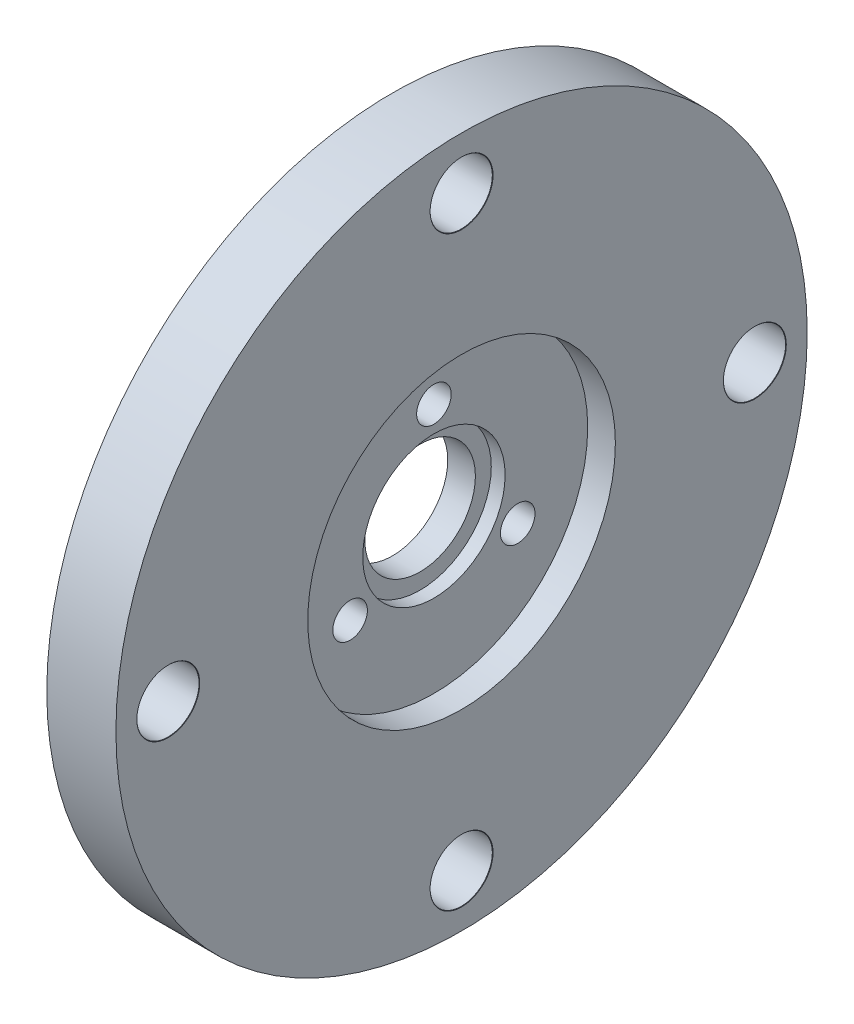
ISO-10303-21;
HEADER;
FILE_DESCRIPTION(('STEP AP214'),'2;1');
FILE_NAME('part.step','',(''),(''),'','','');
FILE_SCHEMA(('AUTOMOTIVE_DESIGN { 1 0 10303 214 1 1 1 1 }'));
ENDSEC;
DATA;
#1=APPLICATION_CONTEXT('core data for automotive mechanical design processes');
#2=APPLICATION_PROTOCOL_DEFINITION('international standard','automotive_design',2000,#1);
#3=PRODUCT_CONTEXT('',#1,'mechanical');
#4=PRODUCT('Part','Part','',(#3));
#5=PRODUCT_RELATED_PRODUCT_CATEGORY('part','',(#4));
#6=PRODUCT_DEFINITION_FORMATION('','',#4);
#7=PRODUCT_DEFINITION_CONTEXT('part definition',#1,'design');
#8=PRODUCT_DEFINITION('design','',#6,#7);
#9=PRODUCT_DEFINITION_SHAPE('','',#8);
#10=(LENGTH_UNIT() NAMED_UNIT(*) SI_UNIT(.MILLI.,.METRE.));
#11=(NAMED_UNIT(*) PLANE_ANGLE_UNIT() SI_UNIT($,.RADIAN.));
#12=(NAMED_UNIT(*) SI_UNIT($,.STERADIAN.) SOLID_ANGLE_UNIT());
#13=UNCERTAINTY_MEASURE_WITH_UNIT(LENGTH_MEASURE(1.E-05),#10,'distance_accuracy_value','');
#14=(GEOMETRIC_REPRESENTATION_CONTEXT(3) GLOBAL_UNCERTAINTY_ASSIGNED_CONTEXT((#13)) GLOBAL_UNIT_ASSIGNED_CONTEXT((#10,
#11,#12)) REPRESENTATION_CONTEXT('',''));
#15=CARTESIAN_POINT('',(0.,0.,0.));
#16=DIRECTION('',(0.,0.,1.));
#17=DIRECTION('',(1.,0.,0.));
#18=AXIS2_PLACEMENT_3D('',#15,#16,#17);
#19=CARTESIAN_POINT('',(2.,0.,0.));
#20=DIRECTION('',(1.,0.,0.));
#21=DIRECTION('',(0.,0.,-1.));
#22=AXIS2_PLACEMENT_3D('',#19,#20,#21);
#23=CYLINDRICAL_SURFACE('',#22,5.15);
#24=CARTESIAN_POINT('',(2.,0.,0.));
#25=DIRECTION('',(1.,0.,0.));
#26=DIRECTION('',(0.,0.,-1.));
#27=AXIS2_PLACEMENT_3D('',#24,#25,#26);
#28=CIRCLE('',#27,5.15);
#29=CARTESIAN_POINT('',(2.,0.,-5.15));
#30=VERTEX_POINT('',#29);
#31=EDGE_CURVE('E66',#30,#30,#28,.T.);
#32=ORIENTED_EDGE('',*,*,#31,.F.);
#33=EDGE_LOOP('',(#32));
#34=FACE_BOUND('',#33,.T.);
#35=CARTESIAN_POINT('',(3.,0.,0.));
#36=DIRECTION('',(1.,0.,0.));
#37=DIRECTION('',(0.,0.,-1.));
#38=AXIS2_PLACEMENT_3D('',#35,#36,#37);
#39=CIRCLE('',#38,5.15);
#40=CARTESIAN_POINT('',(3.,0.,-5.15));
#41=VERTEX_POINT('',#40);
#42=EDGE_CURVE('E67',#41,#41,#39,.F.);
#43=ORIENTED_EDGE('',*,*,#42,.F.);
#44=EDGE_LOOP('',(#43));
#45=FACE_BOUND('',#44,.T.);
#46=ADVANCED_FACE('F42',(#34,#45),#23,.F.);
#47=CARTESIAN_POINT('',(5.,0.,0.));
#48=DIRECTION('',(-1.,0.,0.));
#49=DIRECTION('',(0.,0.,1.));
#50=AXIS2_PLACEMENT_3D('',#47,#48,#49);
#51=CYLINDRICAL_SURFACE('',#50,4.);
#52=CARTESIAN_POINT('',(0.,0.,0.));
#53=DIRECTION('',(1.,0.,0.));
#54=DIRECTION('',(0.,0.,-1.));
#55=AXIS2_PLACEMENT_3D('',#52,#53,#54);
#56=CIRCLE('',#55,4.);
#57=CARTESIAN_POINT('',(0.,0.,-4.));
#58=VERTEX_POINT('',#57);
#59=EDGE_CURVE('E57',#58,#58,#56,.T.);
#60=ORIENTED_EDGE('',*,*,#59,.F.);
#61=EDGE_LOOP('',(#60));
#62=FACE_BOUND('',#61,.T.);
#63=CARTESIAN_POINT('',(2.,0.,0.));
#64=DIRECTION('',(1.,0.,0.));
#65=DIRECTION('',(0.,0.,-1.));
#66=AXIS2_PLACEMENT_3D('',#63,#64,#65);
#67=CIRCLE('',#66,4.);
#68=CARTESIAN_POINT('',(2.,0.,-4.));
#69=VERTEX_POINT('',#68);
#70=EDGE_CURVE('E62',#69,#69,#67,.T.);
#71=ORIENTED_EDGE('',*,*,#70,.T.);
#72=EDGE_LOOP('',(#71));
#73=FACE_BOUND('',#72,.T.);
#74=ADVANCED_FACE('F150',(#62,#73),#51,.F.);
#75=CARTESIAN_POINT('',(5.,0.,0.));
#76=DIRECTION('',(1.,0.,0.));
#77=DIRECTION('',(0.,0.,-1.));
#78=AXIS2_PLACEMENT_3D('',#75,#76,#77);
#79=PLANE('',#78);
#80=CARTESIAN_POINT('',(5.,0.,21.2132034355964));
#81=DIRECTION('',(1.,0.,0.));
#82=DIRECTION('',(0.,0.,-1.));
#83=AXIS2_PLACEMENT_3D('',#80,#81,#82);
#84=CIRCLE('',#83,2.275);
#85=CARTESIAN_POINT('',(5.,0.,18.9382034355964));
#86=VERTEX_POINT('',#85);
#87=EDGE_CURVE('E268',#86,#86,#84,.T.);
#88=ORIENTED_EDGE('',*,*,#87,.F.);
#89=EDGE_LOOP('',(#88));
#90=FACE_BOUND('',#89,.T.);
#91=CARTESIAN_POINT('',(5.,21.2132034355964,0.));
#92=DIRECTION('',(1.,0.,0.));
#93=DIRECTION('',(0.,0.,-1.));
#94=AXIS2_PLACEMENT_3D('',#91,#92,#93);
#95=CIRCLE('',#94,2.275);
#96=CARTESIAN_POINT('',(5.,21.2132034355964,-2.275));
#97=VERTEX_POINT('',#96);
#98=EDGE_CURVE('E95',#97,#97,#95,.T.);
#99=ORIENTED_EDGE('',*,*,#98,.F.);
#100=EDGE_LOOP('',(#99));
#101=FACE_BOUND('',#100,.T.);
#102=CARTESIAN_POINT('',(5.,0.,-21.2132034355964));
#103=DIRECTION('',(1.,0.,0.));
#104=DIRECTION('',(0.,0.,-1.));
#105=AXIS2_PLACEMENT_3D('',#102,#103,#104);
#106=CIRCLE('',#105,2.275);
#107=CARTESIAN_POINT('',(5.,0.,-23.4882034355964));
#108=VERTEX_POINT('',#107);
#109=EDGE_CURVE('E86',#108,#108,#106,.T.);
#110=ORIENTED_EDGE('',*,*,#109,.F.);
#111=EDGE_LOOP('',(#110));
#112=FACE_BOUND('',#111,.T.);
#113=CARTESIAN_POINT('',(5.,-21.2132034355964,0.));
#114=DIRECTION('',(1.,0.,0.));
#115=DIRECTION('',(0.,0.,-1.));
#116=AXIS2_PLACEMENT_3D('',#113,#114,#115);
#117=CIRCLE('',#116,2.275);
#118=CARTESIAN_POINT('',(5.,-21.2132034355964,-2.275));
#119=VERTEX_POINT('',#118);
#120=EDGE_CURVE('E81',#119,#119,#117,.T.);
#121=ORIENTED_EDGE('',*,*,#120,.F.);
#122=EDGE_LOOP('',(#121));
#123=FACE_BOUND('',#122,.T.);
#124=CARTESIAN_POINT('',(5.,0.,0.));
#125=DIRECTION('',(1.,0.,0.));
#126=DIRECTION('',(0.,0.,-1.));
#127=AXIS2_PLACEMENT_3D('',#124,#125,#126);
#128=CIRCLE('',#127,11.125);
#129=CARTESIAN_POINT('',(5.,0.,-11.125));
#130=VERTEX_POINT('',#129);
#131=EDGE_CURVE('E117',#130,#130,#128,.T.);
#132=ORIENTED_EDGE('',*,*,#131,.F.);
#133=EDGE_LOOP('',(#132));
#134=FACE_BOUND('',#133,.T.);
#135=CARTESIAN_POINT('',(5.,0.,0.));
#136=DIRECTION('',(1.,0.,0.));
#137=DIRECTION('',(0.,0.,-1.));
#138=AXIS2_PLACEMENT_3D('',#135,#136,#137);
#139=CIRCLE('',#138,25.);
#140=CARTESIAN_POINT('',(5.,0.,-25.));
#141=VERTEX_POINT('',#140);
#142=EDGE_CURVE('E10',#141,#141,#139,.T.);
#143=ORIENTED_EDGE('',*,*,#142,.T.);
#144=EDGE_LOOP('',(#143));
#145=FACE_BOUND('',#144,.T.);
#146=ADVANCED_FACE('F176',(#90,#101,#112,#123,#134,#145),#79,.T.);
#147=CARTESIAN_POINT('',(0.,0.,0.));
#148=DIRECTION('',(1.,0.,0.));
#149=DIRECTION('',(0.,0.,-1.));
#150=AXIS2_PLACEMENT_3D('',#147,#148,#149);
#151=PLANE('',#150);
#152=CARTESIAN_POINT('',(0.,0.,21.2132034355964));
#153=DIRECTION('',(1.,0.,0.));
#154=DIRECTION('',(0.,0.,-1.));
#155=AXIS2_PLACEMENT_3D('',#152,#153,#154);
#156=CIRCLE('',#155,2.25);
#157=CARTESIAN_POINT('',(0.,0.,18.9632034355964));
#158=VERTEX_POINT('',#157);
#159=EDGE_CURVE('E46',#158,#158,#156,.T.);
#160=ORIENTED_EDGE('',*,*,#159,.T.);
#161=EDGE_LOOP('',(#160));
#162=FACE_BOUND('',#161,.T.);
#163=CARTESIAN_POINT('',(0.,21.2132034355964,0.));
#164=DIRECTION('',(1.,0.,0.));
#165=DIRECTION('',(0.,0.,-1.));
#166=AXIS2_PLACEMENT_3D('',#163,#164,#165);
#167=CIRCLE('',#166,2.25);
#168=CARTESIAN_POINT('',(0.,21.2132034355964,-2.25));
#169=VERTEX_POINT('',#168);
#170=EDGE_CURVE('E83',#169,#169,#167,.T.);
#171=ORIENTED_EDGE('',*,*,#170,.T.);
#172=EDGE_LOOP('',(#171));
#173=FACE_BOUND('',#172,.T.);
#174=CARTESIAN_POINT('',(0.,0.,-21.2132034355964));
#175=DIRECTION('',(1.,0.,0.));
#176=DIRECTION('',(0.,0.,-1.));
#177=AXIS2_PLACEMENT_3D('',#174,#175,#176);
#178=CIRCLE('',#177,2.25);
#179=CARTESIAN_POINT('',(0.,0.,-23.4632034355964));
#180=VERTEX_POINT('',#179);
#181=EDGE_CURVE('E78',#180,#180,#178,.T.);
#182=ORIENTED_EDGE('',*,*,#181,.T.);
#183=EDGE_LOOP('',(#182));
#184=FACE_BOUND('',#183,.T.);
#185=CARTESIAN_POINT('',(0.,-21.2132034355964,0.));
#186=DIRECTION('',(1.,0.,0.));
#187=DIRECTION('',(0.,0.,-1.));
#188=AXIS2_PLACEMENT_3D('',#185,#186,#187);
#189=CIRCLE('',#188,2.25);
#190=CARTESIAN_POINT('',(0.,-21.2132034355964,-2.25));
#191=VERTEX_POINT('',#190);
#192=EDGE_CURVE('E72',#191,#191,#189,.T.);
#193=ORIENTED_EDGE('',*,*,#192,.T.);
#194=EDGE_LOOP('',(#193));
#195=FACE_BOUND('',#194,.T.);
#196=CARTESIAN_POINT('',(0.,7.,0.));
#197=DIRECTION('',(1.,0.,0.));
#198=DIRECTION('',(0.,0.,-1.));
#199=AXIS2_PLACEMENT_3D('',#196,#197,#198);
#200=CIRCLE('',#199,1.25);
#201=CARTESIAN_POINT('',(0.,7.,-1.25));
#202=VERTEX_POINT('',#201);
#203=EDGE_CURVE('E113',#202,#202,#200,.T.);
#204=ORIENTED_EDGE('',*,*,#203,.T.);
#205=EDGE_LOOP('',(#204));
#206=FACE_BOUND('',#205,.T.);
#207=CARTESIAN_POINT('',(0.,-3.5,-6.06217782649107));
#208=DIRECTION('',(1.,0.,0.));
#209=DIRECTION('',(0.,0.,-1.));
#210=AXIS2_PLACEMENT_3D('',#207,#208,#209);
#211=CIRCLE('',#210,1.25);
#212=CARTESIAN_POINT('',(0.,-3.5,-7.31217782649107));
#213=VERTEX_POINT('',#212);
#214=EDGE_CURVE('E122',#213,#213,#211,.T.);
#215=ORIENTED_EDGE('',*,*,#214,.T.);
#216=EDGE_LOOP('',(#215));
#217=FACE_BOUND('',#216,.T.);
#218=CARTESIAN_POINT('',(0.,-3.5,6.06217782649107));
#219=DIRECTION('',(1.,0.,0.));
#220=DIRECTION('',(0.,0.,-1.));
#221=AXIS2_PLACEMENT_3D('',#218,#219,#220);
#222=CIRCLE('',#221,1.25);
#223=CARTESIAN_POINT('',(0.,-3.5,4.81217782649107));
#224=VERTEX_POINT('',#223);
#225=EDGE_CURVE('E130',#224,#224,#222,.T.);
#226=ORIENTED_EDGE('',*,*,#225,.T.);
#227=EDGE_LOOP('',(#226));
#228=FACE_BOUND('',#227,.T.);
#229=CARTESIAN_POINT('',(0.,0.,0.));
#230=DIRECTION('',(1.,0.,0.));
#231=DIRECTION('',(0.,0.,-1.));
#232=AXIS2_PLACEMENT_3D('',#229,#230,#231);
#233=CIRCLE('',#232,25.);
#234=CARTESIAN_POINT('',(0.,0.,-25.));
#235=VERTEX_POINT('',#234);
#236=EDGE_CURVE('E51',#235,#235,#233,.T.);
#237=ORIENTED_EDGE('',*,*,#236,.F.);
#238=EDGE_LOOP('',(#237));
#239=FACE_BOUND('',#238,.T.);
#240=ORIENTED_EDGE('',*,*,#59,.T.);
#241=EDGE_LOOP('',(#240));
#242=FACE_BOUND('',#241,.T.);
#243=ADVANCED_FACE('F179',(#162,#173,#184,#195,#206,#217,#228,#239,#242),#151,.F.);
#244=CARTESIAN_POINT('',(5.,0.,0.));
#245=DIRECTION('',(-1.,0.,0.));
#246=DIRECTION('',(0.,0.,1.));
#247=AXIS2_PLACEMENT_3D('',#244,#245,#246);
#248=CYLINDRICAL_SURFACE('',#247,25.);
#249=ORIENTED_EDGE('',*,*,#142,.F.);
#250=EDGE_LOOP('',(#249));
#251=FACE_BOUND('',#250,.T.);
#252=ORIENTED_EDGE('',*,*,#236,.T.);
#253=EDGE_LOOP('',(#252));
#254=FACE_BOUND('',#253,.T.);
#255=ADVANCED_FACE('F44',(#251,#254),#248,.T.);
#256=CARTESIAN_POINT('',(2.,0.,0.));
#257=DIRECTION('',(1.,0.,0.));
#258=DIRECTION('',(0.,0.,-1.));
#259=AXIS2_PLACEMENT_3D('',#256,#257,#258);
#260=PLANE('',#259);
#261=ORIENTED_EDGE('',*,*,#70,.F.);
#262=EDGE_LOOP('',(#261));
#263=FACE_BOUND('',#262,.T.);
#264=ORIENTED_EDGE('',*,*,#31,.T.);
#265=EDGE_LOOP('',(#264));
#266=FACE_BOUND('',#265,.T.);
#267=ADVANCED_FACE('F146',(#263,#266),#260,.T.);
#268=CARTESIAN_POINT('',(3.,0.,0.));
#269=DIRECTION('',(1.,0.,0.));
#270=DIRECTION('',(0.,0.,-1.));
#271=AXIS2_PLACEMENT_3D('',#268,#269,#270);
#272=PLANE('',#271);
#273=CARTESIAN_POINT('',(3.,7.,0.));
#274=DIRECTION('',(1.,0.,0.));
#275=DIRECTION('',(0.,0.,-1.));
#276=AXIS2_PLACEMENT_3D('',#273,#274,#275);
#277=CIRCLE('',#276,1.25);
#278=CARTESIAN_POINT('',(3.,7.,-1.25));
#279=VERTEX_POINT('',#278);
#280=EDGE_CURVE('E118',#279,#279,#277,.T.);
#281=ORIENTED_EDGE('',*,*,#280,.F.);
#282=EDGE_LOOP('',(#281));
#283=FACE_BOUND('',#282,.T.);
#284=CARTESIAN_POINT('',(3.,-3.5,-6.06217782649107));
#285=DIRECTION('',(1.,0.,0.));
#286=DIRECTION('',(0.,0.,-1.));
#287=AXIS2_PLACEMENT_3D('',#284,#285,#286);
#288=CIRCLE('',#287,1.25);
#289=CARTESIAN_POINT('',(3.,-3.5,-7.31217782649107));
#290=VERTEX_POINT('',#289);
#291=EDGE_CURVE('E126',#290,#290,#288,.T.);
#292=ORIENTED_EDGE('',*,*,#291,.F.);
#293=EDGE_LOOP('',(#292));
#294=FACE_BOUND('',#293,.T.);
#295=CARTESIAN_POINT('',(3.,-3.5,6.06217782649107));
#296=DIRECTION('',(1.,0.,0.));
#297=DIRECTION('',(0.,0.,-1.));
#298=AXIS2_PLACEMENT_3D('',#295,#296,#297);
#299=CIRCLE('',#298,1.25);
#300=CARTESIAN_POINT('',(3.,-3.5,4.81217782649107));
#301=VERTEX_POINT('',#300);
#302=EDGE_CURVE('E76',#301,#301,#299,.T.);
#303=ORIENTED_EDGE('',*,*,#302,.F.);
#304=EDGE_LOOP('',(#303));
#305=FACE_BOUND('',#304,.T.);
#306=CARTESIAN_POINT('',(3.,0.,0.));
#307=DIRECTION('',(1.,0.,0.));
#308=DIRECTION('',(0.,0.,-1.));
#309=AXIS2_PLACEMENT_3D('',#306,#307,#308);
#310=CIRCLE('',#309,11.125);
#311=CARTESIAN_POINT('',(3.,0.,-11.125));
#312=VERTEX_POINT('',#311);
#313=EDGE_CURVE('E71',#312,#312,#310,.T.);
#314=ORIENTED_EDGE('',*,*,#313,.T.);
#315=EDGE_LOOP('',(#314));
#316=FACE_BOUND('',#315,.T.);
#317=ORIENTED_EDGE('',*,*,#42,.T.);
#318=EDGE_LOOP('',(#317));
#319=FACE_BOUND('',#318,.T.);
#320=ADVANCED_FACE('F154',(#283,#294,#305,#316,#319),#272,.T.);
#321=CARTESIAN_POINT('',(3.,0.,0.));
#322=DIRECTION('',(1.,0.,0.));
#323=DIRECTION('',(0.,0.,-1.));
#324=AXIS2_PLACEMENT_3D('',#321,#322,#323);
#325=CYLINDRICAL_SURFACE('',#324,11.125);
#326=ORIENTED_EDGE('',*,*,#313,.F.);
#327=EDGE_LOOP('',(#326));
#328=FACE_BOUND('',#327,.T.);
#329=ORIENTED_EDGE('',*,*,#131,.T.);
#330=EDGE_LOOP('',(#329));
#331=FACE_BOUND('',#330,.T.);
#332=ADVANCED_FACE('F156',(#328,#331),#325,.F.);
#333=CARTESIAN_POINT('',(0.,-3.5,6.06217782649107));
#334=DIRECTION('',(1.,0.,0.));
#335=DIRECTION('',(0.,0.,-1.));
#336=AXIS2_PLACEMENT_3D('',#333,#334,#335);
#337=CYLINDRICAL_SURFACE('',#336,1.25);
#338=ORIENTED_EDGE('',*,*,#225,.F.);
#339=EDGE_LOOP('',(#338));
#340=FACE_BOUND('',#339,.T.);
#341=ORIENTED_EDGE('',*,*,#302,.T.);
#342=EDGE_LOOP('',(#341));
#343=FACE_BOUND('',#342,.T.);
#344=ADVANCED_FACE('F163',(#340,#343),#337,.F.);
#345=CARTESIAN_POINT('',(0.,-3.5,-6.06217782649107));
#346=DIRECTION('',(1.,0.,0.));
#347=DIRECTION('',(0.,0.,-1.));
#348=AXIS2_PLACEMENT_3D('',#345,#346,#347);
#349=CYLINDRICAL_SURFACE('',#348,1.25);
#350=ORIENTED_EDGE('',*,*,#214,.F.);
#351=EDGE_LOOP('',(#350));
#352=FACE_BOUND('',#351,.T.);
#353=ORIENTED_EDGE('',*,*,#291,.T.);
#354=EDGE_LOOP('',(#353));
#355=FACE_BOUND('',#354,.T.);
#356=ADVANCED_FACE('F211',(#352,#355),#349,.F.);
#357=CARTESIAN_POINT('',(0.,7.,0.));
#358=DIRECTION('',(1.,0.,0.));
#359=DIRECTION('',(0.,0.,-1.));
#360=AXIS2_PLACEMENT_3D('',#357,#358,#359);
#361=CYLINDRICAL_SURFACE('',#360,1.25);
#362=ORIENTED_EDGE('',*,*,#203,.F.);
#363=EDGE_LOOP('',(#362));
#364=FACE_BOUND('',#363,.T.);
#365=ORIENTED_EDGE('',*,*,#280,.T.);
#366=EDGE_LOOP('',(#365));
#367=FACE_BOUND('',#366,.T.);
#368=ADVANCED_FACE('F222',(#364,#367),#361,.F.);
#369=CARTESIAN_POINT('',(5.,-21.2132034355964,0.));
#370=DIRECTION('',(1.,0.,0.));
#371=DIRECTION('',(0.,0.,-1.));
#372=AXIS2_PLACEMENT_3D('',#369,#370,#371);
#373=CYLINDRICAL_SURFACE('',#372,2.25);
#374=CARTESIAN_POINT('',(4.975,-21.2132034355964,0.));
#375=DIRECTION('',(1.,0.,0.));
#376=DIRECTION('',(0.,0.,-1.));
#377=AXIS2_PLACEMENT_3D('',#374,#375,#376);
#378=CIRCLE('',#377,2.25);
#379=CARTESIAN_POINT('',(4.975,-21.2132034355964,-2.25));
#380=VERTEX_POINT('',#379);
#381=EDGE_CURVE('E77',#380,#380,#378,.T.);
#382=ORIENTED_EDGE('',*,*,#381,.T.);
#383=EDGE_LOOP('',(#382));
#384=FACE_BOUND('',#383,.T.);
#385=ORIENTED_EDGE('',*,*,#192,.F.);
#386=EDGE_LOOP('',(#385));
#387=FACE_BOUND('',#386,.T.);
#388=ADVANCED_FACE('F227',(#384,#387),#373,.F.);
#389=CARTESIAN_POINT('',(5.,-21.2132034355964,0.));
#390=DIRECTION('',(1.,0.,0.));
#391=DIRECTION('',(0.,0.,-1.));
#392=AXIS2_PLACEMENT_3D('',#389,#390,#391);
#393=CONICAL_SURFACE('',#392,2.275,0.785398163397448);
#394=ORIENTED_EDGE('',*,*,#381,.F.);
#395=EDGE_LOOP('',(#394));
#396=FACE_BOUND('',#395,.T.);
#397=ORIENTED_EDGE('',*,*,#120,.T.);
#398=EDGE_LOOP('',(#397));
#399=FACE_BOUND('',#398,.T.);
#400=ADVANCED_FACE('F233',(#396,#399),#393,.F.);
#401=CARTESIAN_POINT('',(5.,0.,-21.2132034355964));
#402=DIRECTION('',(1.,0.,0.));
#403=DIRECTION('',(0.,0.,-1.));
#404=AXIS2_PLACEMENT_3D('',#401,#402,#403);
#405=CYLINDRICAL_SURFACE('',#404,2.25);
#406=CARTESIAN_POINT('',(4.975,0.,-21.2132034355964));
#407=DIRECTION('',(1.,0.,0.));
#408=DIRECTION('',(0.,0.,-1.));
#409=AXIS2_PLACEMENT_3D('',#406,#407,#408);
#410=CIRCLE('',#409,2.25);
#411=CARTESIAN_POINT('',(4.975,0.,-23.4632034355964));
#412=VERTEX_POINT('',#411);
#413=EDGE_CURVE('E82',#412,#412,#410,.T.);
#414=ORIENTED_EDGE('',*,*,#413,.T.);
#415=EDGE_LOOP('',(#414));
#416=FACE_BOUND('',#415,.T.);
#417=ORIENTED_EDGE('',*,*,#181,.F.);
#418=EDGE_LOOP('',(#417));
#419=FACE_BOUND('',#418,.T.);
#420=ADVANCED_FACE('F237',(#416,#419),#405,.F.);
#421=CARTESIAN_POINT('',(5.,0.,-21.2132034355964));
#422=DIRECTION('',(1.,0.,0.));
#423=DIRECTION('',(0.,0.,-1.));
#424=AXIS2_PLACEMENT_3D('',#421,#422,#423);
#425=CONICAL_SURFACE('',#424,2.275,0.785398163397448);
#426=ORIENTED_EDGE('',*,*,#413,.F.);
#427=EDGE_LOOP('',(#426));
#428=FACE_BOUND('',#427,.T.);
#429=ORIENTED_EDGE('',*,*,#109,.T.);
#430=EDGE_LOOP('',(#429));
#431=FACE_BOUND('',#430,.T.);
#432=ADVANCED_FACE('F241',(#428,#431),#425,.F.);
#433=CARTESIAN_POINT('',(5.,21.2132034355964,0.));
#434=DIRECTION('',(1.,0.,0.));
#435=DIRECTION('',(0.,0.,-1.));
#436=AXIS2_PLACEMENT_3D('',#433,#434,#435);
#437=CYLINDRICAL_SURFACE('',#436,2.25);
#438=CARTESIAN_POINT('',(4.975,21.2132034355964,0.));
#439=DIRECTION('',(1.,0.,0.));
#440=DIRECTION('',(0.,0.,-1.));
#441=AXIS2_PLACEMENT_3D('',#438,#439,#440);
#442=CIRCLE('',#441,2.25);
#443=CARTESIAN_POINT('',(4.975,21.2132034355964,-2.25));
#444=VERTEX_POINT('',#443);
#445=EDGE_CURVE('E87',#444,#444,#442,.T.);
#446=ORIENTED_EDGE('',*,*,#445,.T.);
#447=EDGE_LOOP('',(#446));
#448=FACE_BOUND('',#447,.T.);
#449=ORIENTED_EDGE('',*,*,#170,.F.);
#450=EDGE_LOOP('',(#449));
#451=FACE_BOUND('',#450,.T.);
#452=ADVANCED_FACE('F245',(#448,#451),#437,.F.);
#453=CARTESIAN_POINT('',(5.,21.2132034355964,0.));
#454=DIRECTION('',(1.,0.,0.));
#455=DIRECTION('',(0.,0.,-1.));
#456=AXIS2_PLACEMENT_3D('',#453,#454,#455);
#457=CONICAL_SURFACE('',#456,2.275,0.785398163397448);
#458=ORIENTED_EDGE('',*,*,#445,.F.);
#459=EDGE_LOOP('',(#458));
#460=FACE_BOUND('',#459,.T.);
#461=ORIENTED_EDGE('',*,*,#98,.T.);
#462=EDGE_LOOP('',(#461));
#463=FACE_BOUND('',#462,.T.);
#464=ADVANCED_FACE('F249',(#460,#463),#457,.F.);
#465=CARTESIAN_POINT('',(5.,0.,21.2132034355964));
#466=DIRECTION('',(1.,0.,0.));
#467=DIRECTION('',(0.,0.,-1.));
#468=AXIS2_PLACEMENT_3D('',#465,#466,#467);
#469=CYLINDRICAL_SURFACE('',#468,2.25);
#470=CARTESIAN_POINT('',(4.975,0.,21.2132034355964));
#471=DIRECTION('',(1.,0.,0.));
#472=DIRECTION('',(0.,0.,-1.));
#473=AXIS2_PLACEMENT_3D('',#470,#471,#472);
#474=CIRCLE('',#473,2.25);
#475=CARTESIAN_POINT('',(4.975,0.,18.9632034355964));
#476=VERTEX_POINT('',#475);
#477=EDGE_CURVE('E265',#476,#476,#474,.T.);
#478=ORIENTED_EDGE('',*,*,#477,.T.);
#479=EDGE_LOOP('',(#478));
#480=FACE_BOUND('',#479,.T.);
#481=ORIENTED_EDGE('',*,*,#159,.F.);
#482=EDGE_LOOP('',(#481));
#483=FACE_BOUND('',#482,.T.);
#484=ADVANCED_FACE('F252',(#480,#483),#469,.F.);
#485=CARTESIAN_POINT('',(5.,0.,21.2132034355964));
#486=DIRECTION('',(1.,0.,0.));
#487=DIRECTION('',(0.,0.,-1.));
#488=AXIS2_PLACEMENT_3D('',#485,#486,#487);
#489=CONICAL_SURFACE('',#488,2.275,0.785398163397448);
#490=ORIENTED_EDGE('',*,*,#477,.F.);
#491=EDGE_LOOP('',(#490));
#492=FACE_BOUND('',#491,.T.);
#493=ORIENTED_EDGE('',*,*,#87,.T.);
#494=EDGE_LOOP('',(#493));
#495=FACE_BOUND('',#494,.T.);
#496=ADVANCED_FACE('F256',(#492,#495),#489,.F.);
#497=CLOSED_SHELL('',(#46,#74,#146,#243,#255,#267,#320,#332,#344,#356,#368,#388,#400,#420,#432,
#452,#464,#484,#496));
#498=MANIFOLD_SOLID_BREP('B2',#497);
#499=ADVANCED_BREP_SHAPE_REPRESENTATION('',(#18,#498),#14);
#500=SHAPE_DEFINITION_REPRESENTATION(#9,#499);
ENDSEC;
END-ISO-10303-21;
